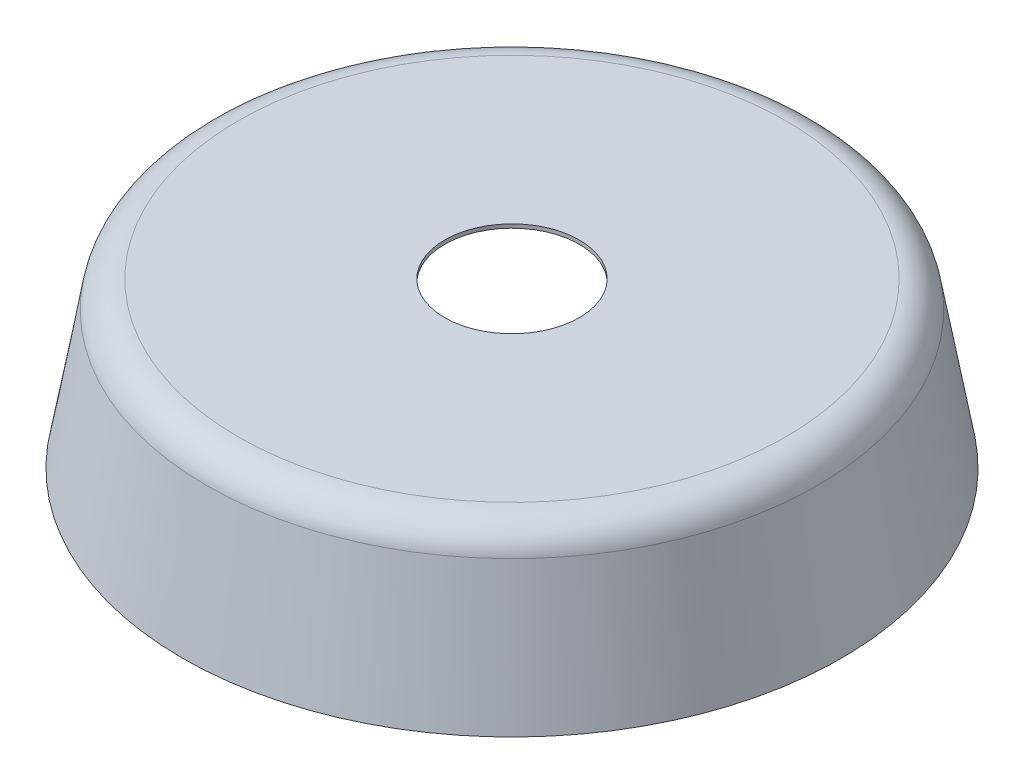
ISO-10303-21;
HEADER;
FILE_DESCRIPTION(('STEP AP214'),'2;1');
FILE_NAME('part.step','',(''),(''),'','','');
FILE_SCHEMA(('AUTOMOTIVE_DESIGN { 1 0 10303 214 1 1 1 1 }'));
ENDSEC;
DATA;
#1=APPLICATION_CONTEXT('core data for automotive mechanical design processes');
#2=APPLICATION_PROTOCOL_DEFINITION('international standard','automotive_design',2000,#1);
#3=PRODUCT_CONTEXT('',#1,'mechanical');
#4=PRODUCT('Part','Part','',(#3));
#5=PRODUCT_RELATED_PRODUCT_CATEGORY('part','',(#4));
#6=PRODUCT_DEFINITION_FORMATION('','',#4);
#7=PRODUCT_DEFINITION_CONTEXT('part definition',#1,'design');
#8=PRODUCT_DEFINITION('design','',#6,#7);
#9=PRODUCT_DEFINITION_SHAPE('','',#8);
#10=(LENGTH_UNIT() NAMED_UNIT(*) SI_UNIT(.MILLI.,.METRE.));
#11=(NAMED_UNIT(*) PLANE_ANGLE_UNIT() SI_UNIT($,.RADIAN.));
#12=(NAMED_UNIT(*) SI_UNIT($,.STERADIAN.) SOLID_ANGLE_UNIT());
#13=UNCERTAINTY_MEASURE_WITH_UNIT(LENGTH_MEASURE(1.E-05),#10,'distance_accuracy_value','');
#14=(GEOMETRIC_REPRESENTATION_CONTEXT(3) GLOBAL_UNCERTAINTY_ASSIGNED_CONTEXT((#13)) GLOBAL_UNIT_ASSIGNED_CONTEXT((#10,
#11,#12)) REPRESENTATION_CONTEXT('',''));
#15=CARTESIAN_POINT('',(0.,0.,0.));
#16=DIRECTION('',(0.,0.,1.));
#17=DIRECTION('',(1.,0.,0.));
#18=AXIS2_PLACEMENT_3D('',#15,#16,#17);
#19=CARTESIAN_POINT('',(0.,87.,0.));
#20=DIRECTION('',(0.,1.,0.));
#21=DIRECTION('',(0.,0.,1.));
#22=AXIS2_PLACEMENT_3D('',#19,#20,#21);
#23=PLANE('',#22);
#24=CARTESIAN_POINT('',(0.,87.,0.));
#25=DIRECTION('',(0.,1.,0.));
#26=DIRECTION('',(0.,0.,1.));
#27=AXIS2_PLACEMENT_3D('',#24,#25,#26);
#28=CIRCLE('',#27,35.75);
#29=CARTESIAN_POINT('',(0.,87.,35.75));
#30=VERTEX_POINT('',#29);
#31=EDGE_CURVE('E109',#30,#30,#28,.T.);
#32=ORIENTED_EDGE('',*,*,#31,.F.);
#33=EDGE_LOOP('',(#32));
#34=FACE_BOUND('',#33,.T.);
#35=CARTESIAN_POINT('',(0.,87.,0.));
#36=DIRECTION('',(0.,1.,0.));
#37=DIRECTION('',(0.,0.,1.));
#38=AXIS2_PLACEMENT_3D('',#35,#36,#37);
#39=CIRCLE('',#38,145.415285439736);
#40=CARTESIAN_POINT('',(0.,87.,145.415285439736));
#41=VERTEX_POINT('',#40);
#42=EDGE_CURVE('E179',#41,#41,#39,.T.);
#43=ORIENTED_EDGE('',*,*,#42,.T.);
#44=EDGE_LOOP('',(#43));
#45=FACE_BOUND('',#44,.T.);
#46=ADVANCED_FACE('F46',(#34,#45),#23,.T.);
#47=CARTESIAN_POINT('',(0.,0.,0.));
#48=DIRECTION('',(0.,1.,0.));
#49=DIRECTION('',(0.,0.,1.));
#50=AXIS2_PLACEMENT_3D('',#47,#48,#49);
#51=PLANE('',#50);
#52=CARTESIAN_POINT('',(0.,0.,0.));
#53=DIRECTION('',(0.,1.,0.));
#54=DIRECTION('',(0.,0.,1.));
#55=AXIS2_PLACEMENT_3D('',#52,#53,#54);
#56=CIRCLE('',#55,173.);
#57=CARTESIAN_POINT('',(0.,0.,173.));
#58=VERTEX_POINT('',#57);
#59=EDGE_CURVE('E190',#58,#58,#56,.T.);
#60=ORIENTED_EDGE('',*,*,#59,.T.);
#61=EDGE_LOOP('',(#60));
#62=FACE_BOUND('',#61,.T.);
#63=CARTESIAN_POINT('',(0.,0.,0.));
#64=DIRECTION('',(0.,1.,0.));
#65=DIRECTION('',(0.,0.,1.));
#66=AXIS2_PLACEMENT_3D('',#63,#64,#65);
#67=CIRCLE('',#66,175.030903117839);
#68=CARTESIAN_POINT('',(0.,0.,175.030903117839));
#69=VERTEX_POINT('',#68);
#70=EDGE_CURVE('E183',#69,#69,#67,.T.);
#71=ORIENTED_EDGE('',*,*,#70,.F.);
#72=EDGE_LOOP('',(#71));
#73=FACE_BOUND('',#72,.T.);
#74=ADVANCED_FACE('F209',(#62,#73),#51,.F.);
#75=CARTESIAN_POINT('',(0.,85.3475706678181,0.));
#76=DIRECTION('',(0.,-1.,0.));
#77=DIRECTION('',(0.,0.,-1.));
#78=AXIS2_PLACEMENT_3D('',#75,#76,#77);
#79=CONICAL_SURFACE('',#78,159.969567117636,0.174672199008236);
#80=CARTESIAN_POINT('',(-6.49999999999997,-156.17005283029,-202.486022879863));
#81=CARTESIAN_POINT('',(-6.49999999999998,-125.141479866878,-197.007563968313));
#82=CARTESIAN_POINT('',(-6.49999999999998,-94.112943397806,-191.528898348829));
#83=CARTESIAN_POINT('',(-6.49999999999999,-32.0559723232724,-180.570990354365));
#84=CARTESIAN_POINT('',(-6.5,-1.02753771781067,-175.091747979385));
#85=CARTESIAN_POINT('',(-6.5,61.0292008051494,-164.132523125365));
#86=CARTESIAN_POINT('',(-6.50000000000001,92.0575047226477,-158.652540646326));
#87=CARTESIAN_POINT('',(-6.50000000000001,154.113929334819,-147.691538251514));
#88=CARTESIAN_POINT('',(-6.50000000000002,185.142050029493,-142.21051833574));
#89=CARTESIAN_POINT('',(-6.50000000000002,216.17005283029,-136.728831037916));
#90=B_SPLINE_CURVE_WITH_KNOTS('',3,(#80,#81,#82,#83,#84,#85,#86,#87,#88,#89),.UNSPECIFIED.,.F.,
.F.,(4,2,2,2,4),(0.,94.525513329373,189.051026597759,283.57653989825,378.102053260587),.UNSPECIFIED.);
#91=CARTESIAN_POINT('',(-6.5,20.,-171.378270315547));
#92=VERTEX_POINT('',#91);
#93=CARTESIAN_POINT('',(-6.5,40.,-167.846267522578));
#94=VERTEX_POINT('',#93);
#95=EDGE_CURVE('E101',#92,#94,#90,.T.);
#96=ORIENTED_EDGE('',*,*,#95,.F.);
#97=CARTESIAN_POINT('',(0.,20.,0.));
#98=DIRECTION('',(0.,-1.,0.));
#99=DIRECTION('',(0.,0.,-1.));
#100=AXIS2_PLACEMENT_3D('',#97,#98,#99);
#101=CIRCLE('',#100,171.501491353133);
#102=CARTESIAN_POINT('',(6.5,20.,-171.378270315547));
#103=VERTEX_POINT('',#102);
#104=EDGE_CURVE('E90',#103,#92,#101,.F.);
#105=ORIENTED_EDGE('',*,*,#104,.F.);
#106=CARTESIAN_POINT('',(6.49999999999998,216.17005283029,-136.728831037916));
#107=CARTESIAN_POINT('',(6.49999999999998,197.030298740822,-140.110245151523));
#108=CARTESIAN_POINT('',(6.49999999999998,177.890497674141,-143.491393345848));
#109=CARTESIAN_POINT('',(6.49999999999999,139.610816987599,-150.253245018612));
#110=CARTESIAN_POINT('',(6.49999999999999,120.470937367739,-153.63394849705));
#111=CARTESIAN_POINT('',(6.5,63.051203798588,-163.775522539312));
#112=CARTESIAN_POINT('',(6.5,24.7712551118572,-170.535856715005));
#113=CARTESIAN_POINT('',(6.50000000000001,-37.2855999139193,-181.494421846779));
#114=CARTESIAN_POINT('',(6.50000000000001,-61.0624524124699,-185.692957704307));
#115=CARTESIAN_POINT('',(6.50000000000002,-108.616213472938,-194.089711976338));
#116=CARTESIAN_POINT('',(6.50000000000002,-132.393122034856,-198.287930390842));
#117=CARTESIAN_POINT('',(6.50000000000002,-156.17005283029,-202.486022879863));
#118=B_SPLINE_CURVE_WITH_KNOTS('',3,(#106,#107,#108,#109,#110,#111,#112,#113,#114,#115,#116,
#117),.UNSPECIFIED.,.F.,.F.,(4,2,2,2,2,4),(0.,58.3084670647495,116.61693411981,233.233868145017,
305.667960688181,378.102053264007),.UNSPECIFIED.);
#119=CARTESIAN_POINT('',(6.5,40.,-167.846267522578));
#120=VERTEX_POINT('',#119);
#121=EDGE_CURVE('E95',#120,#103,#118,.T.);
#122=ORIENTED_EDGE('',*,*,#121,.F.);
#123=CARTESIAN_POINT('',(0.,40.,0.));
#124=DIRECTION('',(0.,1.,0.));
#125=DIRECTION('',(0.,0.,1.));
#126=AXIS2_PLACEMENT_3D('',#123,#124,#125);
#127=CIRCLE('',#126,167.972079588427);
#128=EDGE_CURVE('E108',#94,#120,#127,.F.);
#129=ORIENTED_EDGE('',*,*,#128,.F.);
#130=EDGE_LOOP('',(#96,#105,#122,#129));
#131=FACE_BOUND('',#130,.T.);
#132=CARTESIAN_POINT('',(0.,72.9543506764537,0.));
#133=DIRECTION('',(0.,-1.,0.));
#134=DIRECTION('',(0.,0.,-1.));
#135=AXIS2_PLACEMENT_3D('',#132,#133,#134);
#136=CIRCLE('',#135,162.156605939641);
#137=CARTESIAN_POINT('',(0.,72.9543506764537,-162.156605939641));
#138=VERTEX_POINT('',#137);
#139=EDGE_CURVE('E177',#138,#138,#136,.T.);
#140=ORIENTED_EDGE('',*,*,#139,.T.);
#141=EDGE_LOOP('',(#140));
#142=FACE_BOUND('',#141,.T.);
#143=ORIENTED_EDGE('',*,*,#70,.T.);
#144=EDGE_LOOP('',(#143));
#145=FACE_BOUND('',#144,.T.);
#146=ADVANCED_FACE('F106',(#131,#142,#145),#79,.T.);
#147=CARTESIAN_POINT('',(0.,70.,0.));
#148=DIRECTION('',(0.,1.,0.));
#149=DIRECTION('',(0.,0.,1.));
#150=AXIS2_PLACEMENT_3D('',#147,#148,#149);
#151=TOROIDAL_SURFACE('',#150,145.415285439736,17.);
#152=ORIENTED_EDGE('',*,*,#139,.F.);
#153=EDGE_LOOP('',(#152));
#154=FACE_BOUND('',#153,.T.);
#155=ORIENTED_EDGE('',*,*,#42,.F.);
#156=EDGE_LOOP('',(#155));
#157=FACE_BOUND('',#156,.T.);
#158=ADVANCED_FACE('F48',(#154,#157),#151,.T.);
#159=CARTESIAN_POINT('',(0.,85.,0.));
#160=DIRECTION('',(0.,1.,0.));
#161=DIRECTION('',(0.,0.,1.));
#162=AXIS2_PLACEMENT_3D('',#159,#160,#161);
#163=PLANE('',#162);
#164=CARTESIAN_POINT('',(0.,85.,0.));
#165=DIRECTION('',(0.,1.,0.));
#166=DIRECTION('',(0.,0.,1.));
#167=AXIS2_PLACEMENT_3D('',#164,#165,#166);
#168=CIRCLE('',#167,35.75);
#169=CARTESIAN_POINT('',(0.,85.,35.75));
#170=VERTEX_POINT('',#169);
#171=EDGE_CURVE('E113',#170,#170,#168,.T.);
#172=ORIENTED_EDGE('',*,*,#171,.T.);
#173=EDGE_LOOP('',(#172));
#174=FACE_BOUND('',#173,.T.);
#175=CARTESIAN_POINT('',(0.,85.,0.));
#176=DIRECTION('',(0.,1.,0.));
#177=DIRECTION('',(0.,0.,1.));
#178=AXIS2_PLACEMENT_3D('',#175,#176,#177);
#179=CIRCLE('',#178,145.415285439736);
#180=CARTESIAN_POINT('',(0.,85.,145.415285439736));
#181=VERTEX_POINT('',#180);
#182=EDGE_CURVE('E193',#181,#181,#179,.T.);
#183=ORIENTED_EDGE('',*,*,#182,.F.);
#184=EDGE_LOOP('',(#183));
#185=FACE_BOUND('',#184,.T.);
#186=ADVANCED_FACE('F136',(#174,#185),#163,.F.);
#187=CARTESIAN_POINT('',(0.,85.,0.));
#188=DIRECTION('',(0.,-1.,0.));
#189=DIRECTION('',(0.,0.,-1.));
#190=AXIS2_PLACEMENT_3D('',#187,#188,#189);
#191=CONICAL_SURFACE('',#190,158.,0.174672199008236);
#192=CARTESIAN_POINT('',(0.,20.,0.));
#193=DIRECTION('',(0.,-1.,0.));
#194=DIRECTION('',(0.,0.,-1.));
#195=AXIS2_PLACEMENT_3D('',#192,#193,#194);
#196=CIRCLE('',#195,169.470588235294);
#197=CARTESIAN_POINT('',(6.5,20.,-169.345889459462));
#198=VERTEX_POINT('',#197);
#199=CARTESIAN_POINT('',(-6.5,20.,-169.345889459462));
#200=VERTEX_POINT('',#199);
#201=EDGE_CURVE('E157',#198,#200,#196,.F.);
#202=ORIENTED_EDGE('',*,*,#201,.T.);
#203=CARTESIAN_POINT('',(-6.49999999999997,-154.152432256724,-200.097824872777));
#204=CARTESIAN_POINT('',(-6.49999999999998,-123.460126068997,-194.678670620938));
#205=CARTESIAN_POINT('',(-6.49999999999998,-92.7678568772802,-189.259306821897));
#206=CARTESIAN_POINT('',(-6.49999999999999,-31.3834218035575,-178.419994292231));
#207=CARTESIAN_POINT('',(-6.5,-0.691255921551774,-173.000045561607));
#208=CARTESIAN_POINT('',(-6.5,60.6929432677015,-162.1593973223));
#209=CARTESIAN_POINT('',(-6.50000000000001,91.384976574949,-156.738697813618));
#210=CARTESIAN_POINT('',(-6.50000000000001,152.768857234705,-145.896245911572));
#211=CARTESIAN_POINT('',(-6.50000000000002,183.460704587214,-140.474493518208));
#212=CARTESIAN_POINT('',(-6.50000000000002,214.152432256724,-135.052063631955));
#213=B_SPLINE_CURVE_WITH_KNOTS('',3,(#203,#204,#205,#206,#207,#208,#209,#210,#211,#212),
.UNSPECIFIED.,.F.,.F.,(4,2,2,2,4),(0.,93.5011445267399,187.002288990015,280.503433486736,
374.004578047821),.UNSPECIFIED.);
#214=CARTESIAN_POINT('',(-6.5,40.,-165.813823454026));
#215=VERTEX_POINT('',#214);
#216=EDGE_CURVE('E12',#200,#215,#213,.T.);
#217=ORIENTED_EDGE('',*,*,#216,.T.);
#218=CARTESIAN_POINT('',(0.,40.,0.));
#219=DIRECTION('',(0.,1.,0.));
#220=DIRECTION('',(0.,0.,1.));
#221=AXIS2_PLACEMENT_3D('',#218,#219,#220);
#222=CIRCLE('',#221,165.941176470588);
#223=CARTESIAN_POINT('',(6.5,40.,-165.813823454026));
#224=VERTEX_POINT('',#223);
#225=EDGE_CURVE('E60',#215,#224,#222,.F.);
#226=ORIENTED_EDGE('',*,*,#225,.T.);
#227=CARTESIAN_POINT('',(6.49999999999998,214.152432256724,-135.052063631955));
#228=CARTESIAN_POINT('',(6.49999999999998,195.246881170572,-138.392195163231));
#229=CARTESIAN_POINT('',(6.49999999999998,176.34128252043,-141.732057460918));
#230=CARTESIAN_POINT('',(6.49999999999999,138.530005686402,-148.411331799666));
#231=CARTESIAN_POINT('',(6.49999999999999,119.624327502516,-151.750743840727));
#232=CARTESIAN_POINT('',(6.5,62.9071970606244,-161.76843689144));
#233=CARTESIAN_POINT('',(6.5,25.0956488834474,-168.446174833734));
#234=CARTESIAN_POINT('',(6.50000000000001,-36.2886676577871,-179.286158553684));
#235=CARTESIAN_POINT('',(6.50000000000001,-59.8613817653415,-183.448711583753));
#236=CARTESIAN_POINT('',(6.50000000000002,-107.006867121857,-191.773494103101));
#237=CARTESIAN_POINT('',(6.50000000000002,-130.579638370818,-195.93572359238));
#238=CARTESIAN_POINT('',(6.50000000000002,-154.152432256724,-200.097824872777));
#239=B_SPLINE_CURVE_WITH_KNOTS('',3,(#227,#228,#229,#230,#231,#232,#233,#234,#235,#236,#237,
#238),.UNSPECIFIED.,.F.,.F.,(4,2,2,2,2,4),(0.,57.5950263821731,115.190052754287,
230.380105410353,302.192341713793,374.004578051398),.UNSPECIFIED.);
#240=EDGE_CURVE('E150',#224,#198,#239,.T.);
#241=ORIENTED_EDGE('',*,*,#240,.T.);
#242=EDGE_LOOP('',(#202,#217,#226,#241));
#243=FACE_BOUND('',#242,.T.);
#244=CARTESIAN_POINT('',(0.,72.6067800086356,0.));
#245=DIRECTION('',(0.,1.,0.));
#246=DIRECTION('',(0.,0.,1.));
#247=AXIS2_PLACEMENT_3D('',#244,#245,#246);
#248=CIRCLE('',#247,160.187038822005);
#249=CARTESIAN_POINT('',(0.,72.6067800086356,160.187038822005));
#250=VERTEX_POINT('',#249);
#251=EDGE_CURVE('E188',#250,#250,#248,.F.);
#252=ORIENTED_EDGE('',*,*,#251,.F.);
#253=EDGE_LOOP('',(#252));
#254=FACE_BOUND('',#253,.T.);
#255=ORIENTED_EDGE('',*,*,#59,.F.);
#256=EDGE_LOOP('',(#255));
#257=FACE_BOUND('',#256,.T.);
#258=ADVANCED_FACE('F138',(#243,#254,#257),#191,.F.);
#259=CARTESIAN_POINT('',(0.,70.,0.));
#260=DIRECTION('',(0.,1.,0.));
#261=DIRECTION('',(0.,0.,1.));
#262=AXIS2_PLACEMENT_3D('',#259,#260,#261);
#263=TOROIDAL_SURFACE('',#262,145.415285439736,15.);
#264=ORIENTED_EDGE('',*,*,#251,.T.);
#265=EDGE_LOOP('',(#264));
#266=FACE_BOUND('',#265,.T.);
#267=ORIENTED_EDGE('',*,*,#182,.T.);
#268=EDGE_LOOP('',(#267));
#269=FACE_BOUND('',#268,.T.);
#270=ADVANCED_FACE('F134',(#266,#269),#263,.F.);
#271=CARTESIAN_POINT('',(0.,77.,0.));
#272=DIRECTION('',(0.,1.,0.));
#273=DIRECTION('',(0.,0.,1.));
#274=AXIS2_PLACEMENT_3D('',#271,#272,#273);
#275=CYLINDRICAL_SURFACE('',#274,35.75);
#276=ORIENTED_EDGE('',*,*,#31,.T.);
#277=EDGE_LOOP('',(#276));
#278=FACE_BOUND('',#277,.T.);
#279=ORIENTED_EDGE('',*,*,#171,.F.);
#280=EDGE_LOOP('',(#279));
#281=FACE_BOUND('',#280,.T.);
#282=ADVANCED_FACE('F129',(#278,#281),#275,.F.);
#283=CARTESIAN_POINT('',(-6.5,40.,-175.030903117839));
#284=DIRECTION('',(-1.,0.,0.));
#285=DIRECTION('',(0.,-1.,0.));
#286=AXIS2_PLACEMENT_3D('',#283,#284,#285);
#287=PLANE('',#286);
#288=ORIENTED_EDGE('',*,*,#95,.T.);
#289=DIRECTION('',(0.,0.,1.));
#290=VECTOR('',#289,1.);
#291=CARTESIAN_POINT('',(-6.5,40.,-175.030903117839));
#292=LINE('',#291,#290);
#293=EDGE_CURVE('E96',#94,#215,#292,.T.);
#294=ORIENTED_EDGE('',*,*,#293,.T.);
#295=ORIENTED_EDGE('',*,*,#216,.F.);
#296=DIRECTION('',(0.,0.,1.));
#297=VECTOR('',#296,1.);
#298=CARTESIAN_POINT('',(-6.5,20.,-175.030903117839));
#299=LINE('',#298,#297);
#300=EDGE_CURVE('E72',#92,#200,#299,.T.);
#301=ORIENTED_EDGE('',*,*,#300,.F.);
#302=EDGE_LOOP('',(#288,#294,#295,#301));
#303=FACE_BOUND('',#302,.T.);
#304=ADVANCED_FACE('F99',(#303),#287,.F.);
#305=CARTESIAN_POINT('',(-6.5,40.,-175.030903117839));
#306=DIRECTION('',(0.,1.,0.));
#307=DIRECTION('',(0.,0.,1.));
#308=AXIS2_PLACEMENT_3D('',#305,#306,#307);
#309=PLANE('',#308);
#310=ORIENTED_EDGE('',*,*,#128,.T.);
#311=DIRECTION('',(0.,0.,1.));
#312=VECTOR('',#311,1.);
#313=CARTESIAN_POINT('',(6.5,40.,-175.030903117839));
#314=LINE('',#313,#312);
#315=EDGE_CURVE('E171',#120,#224,#314,.T.);
#316=ORIENTED_EDGE('',*,*,#315,.T.);
#317=ORIENTED_EDGE('',*,*,#225,.F.);
#318=ORIENTED_EDGE('',*,*,#293,.F.);
#319=EDGE_LOOP('',(#310,#316,#317,#318));
#320=FACE_BOUND('',#319,.T.);
#321=ADVANCED_FACE('F128',(#320),#309,.F.);
#322=CARTESIAN_POINT('',(6.5,40.,-175.030903117839));
#323=DIRECTION('',(1.,0.,0.));
#324=DIRECTION('',(0.,1.,0.));
#325=AXIS2_PLACEMENT_3D('',#322,#323,#324);
#326=PLANE('',#325);
#327=ORIENTED_EDGE('',*,*,#121,.T.);
#328=DIRECTION('',(0.,0.,1.));
#329=VECTOR('',#328,1.);
#330=CARTESIAN_POINT('',(6.5,20.,-175.030903117839));
#331=LINE('',#330,#329);
#332=EDGE_CURVE('E67',#103,#198,#331,.T.);
#333=ORIENTED_EDGE('',*,*,#332,.T.);
#334=ORIENTED_EDGE('',*,*,#240,.F.);
#335=ORIENTED_EDGE('',*,*,#315,.F.);
#336=EDGE_LOOP('',(#327,#333,#334,#335));
#337=FACE_BOUND('',#336,.T.);
#338=ADVANCED_FACE('F159',(#337),#326,.F.);
#339=CARTESIAN_POINT('',(-6.5,20.,-175.030903117839));
#340=DIRECTION('',(0.,-1.,0.));
#341=DIRECTION('',(0.,0.,-1.));
#342=AXIS2_PLACEMENT_3D('',#339,#340,#341);
#343=PLANE('',#342);
#344=ORIENTED_EDGE('',*,*,#104,.T.);
#345=ORIENTED_EDGE('',*,*,#300,.T.);
#346=ORIENTED_EDGE('',*,*,#201,.F.);
#347=ORIENTED_EDGE('',*,*,#332,.F.);
#348=EDGE_LOOP('',(#344,#345,#346,#347));
#349=FACE_BOUND('',#348,.T.);
#350=ADVANCED_FACE('F91',(#349),#343,.F.);
#351=CLOSED_SHELL('',(#46,#74,#146,#158,#186,#258,#270,#282,#304,#321,#338,#350));
#352=MANIFOLD_SOLID_BREP('B2',#351);
#353=ADVANCED_BREP_SHAPE_REPRESENTATION('',(#18,#352),#14);
#354=SHAPE_DEFINITION_REPRESENTATION(#9,#353);
ENDSEC;
END-ISO-10303-21;
